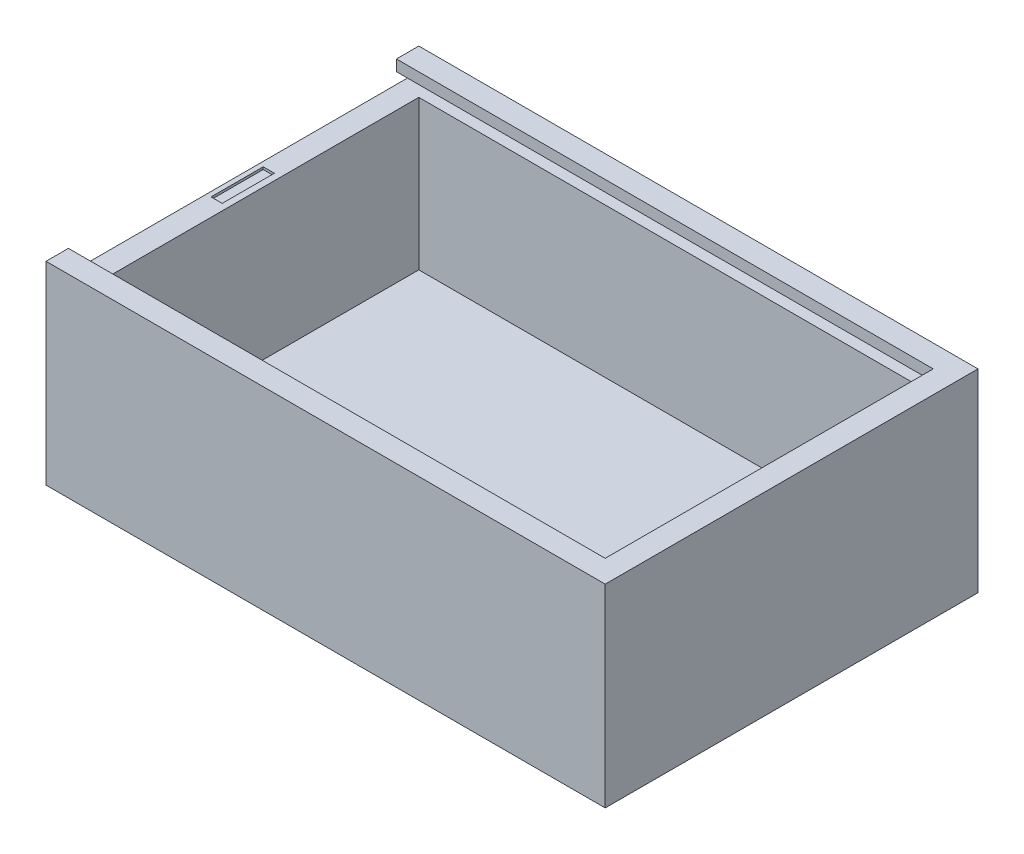
ISO-10303-21;
HEADER;
FILE_DESCRIPTION(('STEP AP214'),'2;1');
FILE_NAME('part.step','',(''),(''),'','','');
FILE_SCHEMA(('AUTOMOTIVE_DESIGN { 1 0 10303 214 1 1 1 1 }'));
ENDSEC;
DATA;
#1=APPLICATION_CONTEXT('core data for automotive mechanical design processes');
#2=APPLICATION_PROTOCOL_DEFINITION('international standard','automotive_design',2000,#1);
#3=PRODUCT_CONTEXT('',#1,'mechanical');
#4=PRODUCT('Part','Part','',(#3));
#5=PRODUCT_RELATED_PRODUCT_CATEGORY('part','',(#4));
#6=PRODUCT_DEFINITION_FORMATION('','',#4);
#7=PRODUCT_DEFINITION_CONTEXT('part definition',#1,'design');
#8=PRODUCT_DEFINITION('design','',#6,#7);
#9=PRODUCT_DEFINITION_SHAPE('','',#8);
#10=(LENGTH_UNIT() NAMED_UNIT(*) SI_UNIT(.MILLI.,.METRE.));
#11=(NAMED_UNIT(*) PLANE_ANGLE_UNIT() SI_UNIT($,.RADIAN.));
#12=(NAMED_UNIT(*) SI_UNIT($,.STERADIAN.) SOLID_ANGLE_UNIT());
#13=UNCERTAINTY_MEASURE_WITH_UNIT(LENGTH_MEASURE(1.E-05),#10,'distance_accuracy_value','');
#14=(GEOMETRIC_REPRESENTATION_CONTEXT(3) GLOBAL_UNCERTAINTY_ASSIGNED_CONTEXT((#13)) GLOBAL_UNIT_ASSIGNED_CONTEXT((#10,
#11,#12)) REPRESENTATION_CONTEXT('',''));
#15=CARTESIAN_POINT('',(0.,0.,0.));
#16=DIRECTION('',(0.,0.,1.));
#17=DIRECTION('',(1.,0.,0.));
#18=AXIS2_PLACEMENT_3D('',#15,#16,#17);
#19=CARTESIAN_POINT('',(34.5,26.,22.));
#20=DIRECTION('',(-1.,0.,0.));
#21=DIRECTION('',(0.,0.,1.));
#22=AXIS2_PLACEMENT_3D('',#19,#20,#21);
#23=PLANE('',#22);
#24=DIRECTION('',(0.,0.,1.));
#25=VECTOR('',#24,1.);
#26=CARTESIAN_POINT('',(34.5,23.04,23.48));
#27=LINE('',#26,#25);
#28=CARTESIAN_POINT('',(34.5,23.04,-22.));
#29=VERTEX_POINT('',#28);
#30=CARTESIAN_POINT('',(34.5,23.04,22.));
#31=VERTEX_POINT('',#30);
#32=EDGE_CURVE('E210',#29,#31,#27,.T.);
#33=ORIENTED_EDGE('',*,*,#32,.F.);
#34=DIRECTION('',(0.,-1.,0.));
#35=VECTOR('',#34,1.);
#36=CARTESIAN_POINT('',(34.5,26.,-22.));
#37=LINE('',#36,#35);
#38=CARTESIAN_POINT('',(34.5,3.00000000000001,-22.));
#39=VERTEX_POINT('',#38);
#40=EDGE_CURVE('E288',#29,#39,#37,.T.);
#41=ORIENTED_EDGE('',*,*,#40,.T.);
#42=DIRECTION('',(0.,0.,-1.));
#43=VECTOR('',#42,1.);
#44=CARTESIAN_POINT('',(34.5,3.,0.));
#45=LINE('',#44,#43);
#46=CARTESIAN_POINT('',(34.5,3.00000000000001,22.));
#47=VERTEX_POINT('',#46);
#48=EDGE_CURVE('E272',#47,#39,#45,.T.);
#49=ORIENTED_EDGE('',*,*,#48,.F.);
#50=DIRECTION('',(0.,-1.,0.));
#51=VECTOR('',#50,1.);
#52=CARTESIAN_POINT('',(34.5,26.,22.));
#53=LINE('',#52,#51);
#54=EDGE_CURVE('E60',#31,#47,#53,.T.);
#55=ORIENTED_EDGE('',*,*,#54,.F.);
#56=EDGE_LOOP('',(#33,#41,#49,#55));
#57=FACE_BOUND('',#56,.T.);
#58=ADVANCED_FACE('F37',(#57),#23,.T.);
#59=CARTESIAN_POINT('',(34.5,26.,22.));
#60=DIRECTION('',(0.,0.,-1.));
#61=DIRECTION('',(-1.,0.,0.));
#62=AXIS2_PLACEMENT_3D('',#59,#60,#61);
#63=PLANE('',#62);
#64=CARTESIAN_POINT('',(34.5,26.,22.));
#65=VERTEX_POINT('',#64);
#66=CARTESIAN_POINT('',(34.5,24.52,22.));
#67=VERTEX_POINT('',#66);
#68=EDGE_CURVE('E292',#65,#67,#53,.T.);
#69=ORIENTED_EDGE('',*,*,#68,.T.);
#70=DIRECTION('',(-1.,0.,0.));
#71=VECTOR('',#70,1.);
#72=CARTESIAN_POINT('',(34.5,24.52,22.));
#73=LINE('',#72,#71);
#74=CARTESIAN_POINT('',(-37.5,24.52,22.));
#75=VERTEX_POINT('',#74);
#76=EDGE_CURVE('E258',#67,#75,#73,.T.);
#77=ORIENTED_EDGE('',*,*,#76,.T.);
#78=DIRECTION('',(0.,1.,0.));
#79=VECTOR('',#78,1.);
#80=CARTESIAN_POINT('',(-37.5,0.,22.));
#81=LINE('',#80,#79);
#82=CARTESIAN_POINT('',(-37.5,26.,22.));
#83=VERTEX_POINT('',#82);
#84=EDGE_CURVE('E238',#75,#83,#81,.T.);
#85=ORIENTED_EDGE('',*,*,#84,.T.);
#86=DIRECTION('',(1.,0.,0.));
#87=VECTOR('',#86,1.);
#88=CARTESIAN_POINT('',(34.5,26.,22.));
#89=LINE('',#88,#87);
#90=EDGE_CURVE('E278',#83,#65,#89,.T.);
#91=ORIENTED_EDGE('',*,*,#90,.T.);
#92=EDGE_LOOP('',(#69,#77,#85,#91));
#93=FACE_BOUND('',#92,.T.);
#94=ADVANCED_FACE('F352',(#93),#63,.T.);
#95=CARTESIAN_POINT('',(34.5,26.,-22.));
#96=DIRECTION('',(0.,0.,1.));
#97=DIRECTION('',(1.,0.,0.));
#98=AXIS2_PLACEMENT_3D('',#95,#96,#97);
#99=PLANE('',#98);
#100=DIRECTION('',(1.,0.,0.));
#101=VECTOR('',#100,1.);
#102=CARTESIAN_POINT('',(34.5,23.04,-22.));
#103=LINE('',#102,#101);
#104=CARTESIAN_POINT('',(-34.5,23.04,-22.));
#105=VERTEX_POINT('',#104);
#106=EDGE_CURVE('E253',#105,#29,#103,.T.);
#107=ORIENTED_EDGE('',*,*,#106,.F.);
#108=DIRECTION('',(0.,-1.,0.));
#109=VECTOR('',#108,1.);
#110=CARTESIAN_POINT('',(-34.5,26.,-22.));
#111=LINE('',#110,#109);
#112=CARTESIAN_POINT('',(-34.5,3.00000000000001,-22.));
#113=VERTEX_POINT('',#112);
#114=EDGE_CURVE('E286',#105,#113,#111,.T.);
#115=ORIENTED_EDGE('',*,*,#114,.T.);
#116=DIRECTION('',(-1.,0.,0.));
#117=VECTOR('',#116,1.);
#118=CARTESIAN_POINT('',(0.,3.,-22.));
#119=LINE('',#118,#117);
#120=EDGE_CURVE('E275',#39,#113,#119,.T.);
#121=ORIENTED_EDGE('',*,*,#120,.F.);
#122=ORIENTED_EDGE('',*,*,#40,.F.);
#123=EDGE_LOOP('',(#107,#115,#121,#122));
#124=FACE_BOUND('',#123,.T.);
#125=ADVANCED_FACE('F386',(#124),#99,.T.);
#126=CARTESIAN_POINT('',(0.,26.,0.));
#127=DIRECTION('',(0.,1.,0.));
#128=DIRECTION('',(0.,0.,1.));
#129=AXIS2_PLACEMENT_3D('',#126,#127,#128);
#130=PLANE('',#129);
#131=DIRECTION('',(0.,0.,1.));
#132=VECTOR('',#131,1.);
#133=CARTESIAN_POINT('',(-37.5,26.,-25.));
#134=LINE('',#133,#132);
#135=CARTESIAN_POINT('',(-37.5,26.,-25.));
#136=VERTEX_POINT('',#135);
#137=CARTESIAN_POINT('',(-37.5,26.,-22.));
#138=VERTEX_POINT('',#137);
#139=EDGE_CURVE('E296',#136,#138,#134,.T.);
#140=ORIENTED_EDGE('',*,*,#139,.T.);
#141=DIRECTION('',(-1.,0.,0.));
#142=VECTOR('',#141,1.);
#143=CARTESIAN_POINT('',(34.5,26.,-22.));
#144=LINE('',#143,#142);
#145=CARTESIAN_POINT('',(34.5,26.,-22.));
#146=VERTEX_POINT('',#145);
#147=EDGE_CURVE('E282',#146,#138,#144,.T.);
#148=ORIENTED_EDGE('',*,*,#147,.F.);
#149=DIRECTION('',(0.,0.,-1.));
#150=VECTOR('',#149,1.);
#151=CARTESIAN_POINT('',(34.5,26.,22.));
#152=LINE('',#151,#150);
#153=EDGE_CURVE('E280',#65,#146,#152,.T.);
#154=ORIENTED_EDGE('',*,*,#153,.F.);
#155=ORIENTED_EDGE('',*,*,#90,.F.);
#156=CARTESIAN_POINT('',(-37.5,26.,25.));
#157=VERTEX_POINT('',#156);
#158=EDGE_CURVE('E300',#83,#157,#134,.T.);
#159=ORIENTED_EDGE('',*,*,#158,.T.);
#160=DIRECTION('',(1.,0.,0.));
#161=VECTOR('',#160,1.);
#162=CARTESIAN_POINT('',(-37.5,26.,25.));
#163=LINE('',#162,#161);
#164=CARTESIAN_POINT('',(37.5,26.,25.));
#165=VERTEX_POINT('',#164);
#166=EDGE_CURVE('E299',#157,#165,#163,.T.);
#167=ORIENTED_EDGE('',*,*,#166,.T.);
#168=DIRECTION('',(0.,0.,-1.));
#169=VECTOR('',#168,1.);
#170=CARTESIAN_POINT('',(37.5,26.,-25.));
#171=LINE('',#170,#169);
#172=CARTESIAN_POINT('',(37.5,26.,-25.));
#173=VERTEX_POINT('',#172);
#174=EDGE_CURVE('E302',#165,#173,#171,.T.);
#175=ORIENTED_EDGE('',*,*,#174,.T.);
#176=DIRECTION('',(-1.,0.,0.));
#177=VECTOR('',#176,1.);
#178=CARTESIAN_POINT('',(-37.5,26.,-25.));
#179=LINE('',#178,#177);
#180=EDGE_CURVE('E304',#173,#136,#179,.T.);
#181=ORIENTED_EDGE('',*,*,#180,.T.);
#182=EDGE_LOOP('',(#140,#148,#154,#155,#159,#167,#175,#181));
#183=FACE_BOUND('',#182,.T.);
#184=ADVANCED_FACE('F346',(#183),#130,.T.);
#185=CARTESIAN_POINT('',(0.,0.,0.));
#186=DIRECTION('',(0.,1.,0.));
#187=DIRECTION('',(0.,0.,1.));
#188=AXIS2_PLACEMENT_3D('',#185,#186,#187);
#189=PLANE('',#188);
#190=DIRECTION('',(0.,0.,1.));
#191=VECTOR('',#190,1.);
#192=CARTESIAN_POINT('',(-37.5,0.,-25.));
#193=LINE('',#192,#191);
#194=CARTESIAN_POINT('',(-37.5,0.,-25.));
#195=VERTEX_POINT('',#194);
#196=CARTESIAN_POINT('',(-37.5,0.,25.));
#197=VERTEX_POINT('',#196);
#198=EDGE_CURVE('E295',#195,#197,#193,.T.);
#199=ORIENTED_EDGE('',*,*,#198,.F.);
#200=DIRECTION('',(-1.,0.,0.));
#201=VECTOR('',#200,1.);
#202=CARTESIAN_POINT('',(-37.5,0.,-25.));
#203=LINE('',#202,#201);
#204=CARTESIAN_POINT('',(37.5,0.,-25.));
#205=VERTEX_POINT('',#204);
#206=EDGE_CURVE('E313',#205,#195,#203,.T.);
#207=ORIENTED_EDGE('',*,*,#206,.F.);
#208=DIRECTION('',(0.,0.,-1.));
#209=VECTOR('',#208,1.);
#210=CARTESIAN_POINT('',(37.5,0.,-25.));
#211=LINE('',#210,#209);
#212=CARTESIAN_POINT('',(37.5,0.,25.));
#213=VERTEX_POINT('',#212);
#214=EDGE_CURVE('E311',#213,#205,#211,.T.);
#215=ORIENTED_EDGE('',*,*,#214,.F.);
#216=DIRECTION('',(1.,0.,0.));
#217=VECTOR('',#216,1.);
#218=CARTESIAN_POINT('',(-37.5,0.,25.));
#219=LINE('',#218,#217);
#220=EDGE_CURVE('E309',#197,#213,#219,.T.);
#221=ORIENTED_EDGE('',*,*,#220,.F.);
#222=EDGE_LOOP('',(#199,#207,#215,#221));
#223=FACE_BOUND('',#222,.T.);
#224=ADVANCED_FACE('F336',(#223),#189,.F.);
#225=CARTESIAN_POINT('',(-37.5,26.,-25.));
#226=DIRECTION('',(1.,0.,0.));
#227=DIRECTION('',(0.,0.,-1.));
#228=AXIS2_PLACEMENT_3D('',#225,#226,#227);
#229=PLANE('',#228);
#230=DIRECTION('',(0.,0.,-1.));
#231=VECTOR('',#230,1.);
#232=CARTESIAN_POINT('',(-37.5,24.52,0.));
#233=LINE('',#232,#231);
#234=CARTESIAN_POINT('',(-37.5,24.52,-22.));
#235=VERTEX_POINT('',#234);
#236=CARTESIAN_POINT('',(-37.5,24.52,-23.48));
#237=VERTEX_POINT('',#236);
#238=EDGE_CURVE('E244',#235,#237,#233,.T.);
#239=ORIENTED_EDGE('',*,*,#238,.F.);
#240=DIRECTION('',(0.,-1.,0.));
#241=VECTOR('',#240,1.);
#242=CARTESIAN_POINT('',(-37.5,0.,-22.));
#243=LINE('',#242,#241);
#244=EDGE_CURVE('E241',#138,#235,#243,.T.);
#245=ORIENTED_EDGE('',*,*,#244,.F.);
#246=ORIENTED_EDGE('',*,*,#139,.F.);
#247=DIRECTION('',(0.,-1.,0.));
#248=VECTOR('',#247,1.);
#249=CARTESIAN_POINT('',(-37.5,26.,-25.));
#250=LINE('',#249,#248);
#251=EDGE_CURVE('E306',#136,#195,#250,.T.);
#252=ORIENTED_EDGE('',*,*,#251,.T.);
#253=ORIENTED_EDGE('',*,*,#198,.T.);
#254=DIRECTION('',(0.,-1.,0.));
#255=VECTOR('',#254,1.);
#256=CARTESIAN_POINT('',(-37.5,26.,25.));
#257=LINE('',#256,#255);
#258=EDGE_CURVE('E45',#157,#197,#257,.T.);
#259=ORIENTED_EDGE('',*,*,#258,.F.);
#260=ORIENTED_EDGE('',*,*,#158,.F.);
#261=ORIENTED_EDGE('',*,*,#84,.F.);
#262=DIRECTION('',(0.,0.,1.));
#263=VECTOR('',#262,1.);
#264=CARTESIAN_POINT('',(-37.5,24.52,0.));
#265=LINE('',#264,#263);
#266=CARTESIAN_POINT('',(-37.5,24.52,23.48));
#267=VERTEX_POINT('',#266);
#268=EDGE_CURVE('E235',#75,#267,#265,.T.);
#269=ORIENTED_EDGE('',*,*,#268,.T.);
#270=DIRECTION('',(0.,-1.,0.));
#271=VECTOR('',#270,1.);
#272=CARTESIAN_POINT('',(-37.5,0.,23.48));
#273=LINE('',#272,#271);
#274=CARTESIAN_POINT('',(-37.5,23.04,23.48));
#275=VERTEX_POINT('',#274);
#276=EDGE_CURVE('E232',#267,#275,#273,.T.);
#277=ORIENTED_EDGE('',*,*,#276,.T.);
#278=DIRECTION('',(0.,0.,1.));
#279=VECTOR('',#278,1.);
#280=CARTESIAN_POINT('',(-37.5,23.04,0.));
#281=LINE('',#280,#279);
#282=CARTESIAN_POINT('',(-37.5,23.04,-23.48));
#283=VERTEX_POINT('',#282);
#284=EDGE_CURVE('E227',#283,#275,#281,.T.);
#285=ORIENTED_EDGE('',*,*,#284,.F.);
#286=DIRECTION('',(0.,-1.,0.));
#287=VECTOR('',#286,1.);
#288=CARTESIAN_POINT('',(-37.5,0.,-23.48));
#289=LINE('',#288,#287);
#290=EDGE_CURVE('E247',#237,#283,#289,.T.);
#291=ORIENTED_EDGE('',*,*,#290,.F.);
#292=EDGE_LOOP('',(#239,#245,#246,#252,#253,#259,#260,#261,#269,#277,#285,#291));
#293=FACE_BOUND('',#292,.T.);
#294=ADVANCED_FACE('F39',(#293),#229,.F.);
#295=CARTESIAN_POINT('',(-37.5,26.,25.));
#296=DIRECTION('',(0.,0.,-1.));
#297=DIRECTION('',(-1.,0.,0.));
#298=AXIS2_PLACEMENT_3D('',#295,#296,#297);
#299=PLANE('',#298);
#300=ORIENTED_EDGE('',*,*,#220,.T.);
#301=DIRECTION('',(0.,-1.,0.));
#302=VECTOR('',#301,1.);
#303=CARTESIAN_POINT('',(37.5,26.,25.));
#304=LINE('',#303,#302);
#305=EDGE_CURVE('E320',#165,#213,#304,.T.);
#306=ORIENTED_EDGE('',*,*,#305,.F.);
#307=ORIENTED_EDGE('',*,*,#166,.F.);
#308=ORIENTED_EDGE('',*,*,#258,.T.);
#309=EDGE_LOOP('',(#300,#306,#307,#308));
#310=FACE_BOUND('',#309,.T.);
#311=ADVANCED_FACE('F326',(#310),#299,.F.);
#312=CARTESIAN_POINT('',(37.5,26.,-25.));
#313=DIRECTION('',(-1.,0.,0.));
#314=DIRECTION('',(0.,0.,1.));
#315=AXIS2_PLACEMENT_3D('',#312,#313,#314);
#316=PLANE('',#315);
#317=ORIENTED_EDGE('',*,*,#214,.T.);
#318=DIRECTION('',(0.,-1.,0.));
#319=VECTOR('',#318,1.);
#320=CARTESIAN_POINT('',(37.5,26.,-25.));
#321=LINE('',#320,#319);
#322=EDGE_CURVE('E317',#173,#205,#321,.T.);
#323=ORIENTED_EDGE('',*,*,#322,.F.);
#324=ORIENTED_EDGE('',*,*,#174,.F.);
#325=ORIENTED_EDGE('',*,*,#305,.T.);
#326=EDGE_LOOP('',(#317,#323,#324,#325));
#327=FACE_BOUND('',#326,.T.);
#328=ADVANCED_FACE('F340',(#327),#316,.F.);
#329=CARTESIAN_POINT('',(-37.5,26.,-25.));
#330=DIRECTION('',(0.,0.,1.));
#331=DIRECTION('',(1.,0.,0.));
#332=AXIS2_PLACEMENT_3D('',#329,#330,#331);
#333=PLANE('',#332);
#334=ORIENTED_EDGE('',*,*,#206,.T.);
#335=ORIENTED_EDGE('',*,*,#251,.F.);
#336=ORIENTED_EDGE('',*,*,#180,.F.);
#337=ORIENTED_EDGE('',*,*,#322,.T.);
#338=EDGE_LOOP('',(#334,#335,#336,#337));
#339=FACE_BOUND('',#338,.T.);
#340=ADVANCED_FACE('F344',(#339),#333,.F.);
#341=DIRECTION('',(-1.,0.,0.));
#342=VECTOR('',#341,1.);
#343=CARTESIAN_POINT('',(34.5,23.04,22.));
#344=LINE('',#343,#342);
#345=CARTESIAN_POINT('',(-34.5,23.04,22.));
#346=VERTEX_POINT('',#345);
#347=EDGE_CURVE('E265',#31,#346,#344,.T.);
#348=ORIENTED_EDGE('',*,*,#347,.F.);
#349=ORIENTED_EDGE('',*,*,#54,.T.);
#350=DIRECTION('',(-1.,0.,0.));
#351=VECTOR('',#350,1.);
#352=CARTESIAN_POINT('',(0.,3.,22.));
#353=LINE('',#352,#351);
#354=CARTESIAN_POINT('',(-34.5,3.,22.));
#355=VERTEX_POINT('',#354);
#356=EDGE_CURVE('E270',#47,#355,#353,.T.);
#357=ORIENTED_EDGE('',*,*,#356,.T.);
#358=DIRECTION('',(0.,-1.,0.));
#359=VECTOR('',#358,1.);
#360=CARTESIAN_POINT('',(-34.5,26.,22.));
#361=LINE('',#360,#359);
#362=EDGE_CURVE('E284',#346,#355,#361,.T.);
#363=ORIENTED_EDGE('',*,*,#362,.F.);
#364=EDGE_LOOP('',(#348,#349,#357,#363));
#365=FACE_BOUND('',#364,.T.);
#366=ADVANCED_FACE('F378',(#365),#63,.T.);
#367=DIRECTION('',(0.,0.,-1.));
#368=VECTOR('',#367,1.);
#369=CARTESIAN_POINT('',(34.5,24.52,-23.48));
#370=LINE('',#369,#368);
#371=CARTESIAN_POINT('',(34.5,24.52,-22.));
#372=VERTEX_POINT('',#371);
#373=EDGE_CURVE('E218',#67,#372,#370,.T.);
#374=ORIENTED_EDGE('',*,*,#373,.F.);
#375=ORIENTED_EDGE('',*,*,#68,.F.);
#376=ORIENTED_EDGE('',*,*,#153,.T.);
#377=EDGE_CURVE('E289',#146,#372,#37,.T.);
#378=ORIENTED_EDGE('',*,*,#377,.T.);
#379=EDGE_LOOP('',(#374,#375,#376,#378));
#380=FACE_BOUND('',#379,.T.);
#381=ADVANCED_FACE('F376',(#380),#23,.T.);
#382=DIRECTION('',(-1.,0.,0.));
#383=VECTOR('',#382,1.);
#384=CARTESIAN_POINT('',(34.5,24.52,-22.));
#385=LINE('',#384,#383);
#386=EDGE_CURVE('E256',#372,#235,#385,.T.);
#387=ORIENTED_EDGE('',*,*,#386,.F.);
#388=ORIENTED_EDGE('',*,*,#377,.F.);
#389=ORIENTED_EDGE('',*,*,#147,.T.);
#390=ORIENTED_EDGE('',*,*,#244,.T.);
#391=EDGE_LOOP('',(#387,#388,#389,#390));
#392=FACE_BOUND('',#391,.T.);
#393=ADVANCED_FACE('F373',(#392),#99,.T.);
#394=CARTESIAN_POINT('',(-34.5,26.,22.));
#395=DIRECTION('',(1.,0.,0.));
#396=DIRECTION('',(0.,0.,-1.));
#397=AXIS2_PLACEMENT_3D('',#394,#395,#396);
#398=PLANE('',#397);
#399=DIRECTION('',(0.,0.,-1.));
#400=VECTOR('',#399,1.);
#401=CARTESIAN_POINT('',(-34.5,23.04,22.));
#402=LINE('',#401,#400);
#403=EDGE_CURVE('E11',#346,#105,#402,.T.);
#404=ORIENTED_EDGE('',*,*,#403,.F.);
#405=ORIENTED_EDGE('',*,*,#362,.T.);
#406=DIRECTION('',(0.,0.,-1.));
#407=VECTOR('',#406,1.);
#408=CARTESIAN_POINT('',(-34.5,3.,0.));
#409=LINE('',#408,#407);
#410=EDGE_CURVE('E267',#355,#113,#409,.T.);
#411=ORIENTED_EDGE('',*,*,#410,.T.);
#412=ORIENTED_EDGE('',*,*,#114,.F.);
#413=EDGE_LOOP('',(#404,#405,#411,#412));
#414=FACE_BOUND('',#413,.T.);
#415=ADVANCED_FACE('F384',(#414),#398,.T.);
#416=CARTESIAN_POINT('',(0.,3.,0.));
#417=DIRECTION('',(0.,1.,0.));
#418=DIRECTION('',(0.,0.,1.));
#419=AXIS2_PLACEMENT_3D('',#416,#417,#418);
#420=PLANE('',#419);
#421=ORIENTED_EDGE('',*,*,#410,.F.);
#422=ORIENTED_EDGE('',*,*,#356,.F.);
#423=ORIENTED_EDGE('',*,*,#48,.T.);
#424=ORIENTED_EDGE('',*,*,#120,.T.);
#425=EDGE_LOOP('',(#421,#422,#423,#424));
#426=FACE_BOUND('',#425,.T.);
#427=ADVANCED_FACE('F403',(#426),#420,.T.);
#428=CARTESIAN_POINT('',(34.5,23.04,0.));
#429=DIRECTION('',(0.,-1.,0.));
#430=DIRECTION('',(0.,0.,-1.));
#431=AXIS2_PLACEMENT_3D('',#428,#429,#430);
#432=PLANE('',#431);
#433=DIRECTION('',(1.,0.,0.));
#434=VECTOR('',#433,1.);
#435=CARTESIAN_POINT('',(-36.87,23.04,3.5));
#436=LINE('',#435,#434);
#437=CARTESIAN_POINT('',(-36.87,23.04,3.5));
#438=VERTEX_POINT('',#437);
#439=CARTESIAN_POINT('',(-35.37,23.04,3.5));
#440=VERTEX_POINT('',#439);
#441=EDGE_CURVE('E204',#438,#440,#436,.T.);
#442=ORIENTED_EDGE('',*,*,#441,.F.);
#443=DIRECTION('',(0.,0.,1.));
#444=VECTOR('',#443,1.);
#445=CARTESIAN_POINT('',(-36.87,23.04,3.5));
#446=LINE('',#445,#444);
#447=CARTESIAN_POINT('',(-36.87,23.04,-3.5));
#448=VERTEX_POINT('',#447);
#449=EDGE_CURVE('E52',#448,#438,#446,.T.);
#450=ORIENTED_EDGE('',*,*,#449,.F.);
#451=DIRECTION('',(-1.,0.,0.));
#452=VECTOR('',#451,1.);
#453=CARTESIAN_POINT('',(-36.87,23.04,-3.5));
#454=LINE('',#453,#452);
#455=CARTESIAN_POINT('',(-35.37,23.04,-3.5));
#456=VERTEX_POINT('',#455);
#457=EDGE_CURVE('E195',#456,#448,#454,.T.);
#458=ORIENTED_EDGE('',*,*,#457,.F.);
#459=DIRECTION('',(0.,0.,-1.));
#460=VECTOR('',#459,1.);
#461=CARTESIAN_POINT('',(-35.37,23.04,3.5));
#462=LINE('',#461,#460);
#463=EDGE_CURVE('E198',#440,#456,#462,.T.);
#464=ORIENTED_EDGE('',*,*,#463,.F.);
#465=EDGE_LOOP('',(#442,#450,#458,#464));
#466=FACE_BOUND('',#465,.T.);
#467=ORIENTED_EDGE('',*,*,#106,.T.);
#468=ORIENTED_EDGE('',*,*,#32,.T.);
#469=ORIENTED_EDGE('',*,*,#347,.T.);
#470=ORIENTED_EDGE('',*,*,#403,.T.);
#471=EDGE_LOOP('',(#467,#468,#469,#470));
#472=FACE_BOUND('',#471,.T.);
#473=DIRECTION('',(0.,0.,1.));
#474=VECTOR('',#473,1.);
#475=CARTESIAN_POINT('',(36.,23.04,23.48));
#476=LINE('',#475,#474);
#477=CARTESIAN_POINT('',(36.,23.04,-23.48));
#478=VERTEX_POINT('',#477);
#479=CARTESIAN_POINT('',(36.,23.04,23.48));
#480=VERTEX_POINT('',#479);
#481=EDGE_CURVE('E214',#478,#480,#476,.T.);
#482=ORIENTED_EDGE('',*,*,#481,.F.);
#483=DIRECTION('',(-1.,0.,0.));
#484=VECTOR('',#483,1.);
#485=CARTESIAN_POINT('',(34.5,23.04,-23.48));
#486=LINE('',#485,#484);
#487=EDGE_CURVE('E251',#478,#283,#486,.T.);
#488=ORIENTED_EDGE('',*,*,#487,.T.);
#489=ORIENTED_EDGE('',*,*,#284,.T.);
#490=DIRECTION('',(-1.,0.,0.));
#491=VECTOR('',#490,1.);
#492=CARTESIAN_POINT('',(34.5,23.04,23.48));
#493=LINE('',#492,#491);
#494=EDGE_CURVE('E250',#480,#275,#493,.T.);
#495=ORIENTED_EDGE('',*,*,#494,.F.);
#496=EDGE_LOOP('',(#482,#488,#489,#495));
#497=FACE_BOUND('',#496,.T.);
#498=ADVANCED_FACE('F366',(#466,#472,#497),#432,.F.);
#499=CARTESIAN_POINT('',(34.5,0.,-23.48));
#500=DIRECTION('',(0.,0.,-1.));
#501=DIRECTION('',(-1.,0.,0.));
#502=AXIS2_PLACEMENT_3D('',#499,#500,#501);
#503=PLANE('',#502);
#504=ORIENTED_EDGE('',*,*,#290,.T.);
#505=ORIENTED_EDGE('',*,*,#487,.F.);
#506=DIRECTION('',(0.,-1.,0.));
#507=VECTOR('',#506,1.);
#508=CARTESIAN_POINT('',(36.,23.04,-23.48));
#509=LINE('',#508,#507);
#510=CARTESIAN_POINT('',(36.,24.52,-23.48));
#511=VERTEX_POINT('',#510);
#512=EDGE_CURVE('E224',#511,#478,#509,.T.);
#513=ORIENTED_EDGE('',*,*,#512,.F.);
#514=DIRECTION('',(-1.,0.,0.));
#515=VECTOR('',#514,1.);
#516=CARTESIAN_POINT('',(34.5,24.52,-23.48));
#517=LINE('',#516,#515);
#518=EDGE_CURVE('E254',#511,#237,#517,.T.);
#519=ORIENTED_EDGE('',*,*,#518,.T.);
#520=EDGE_LOOP('',(#504,#505,#513,#519));
#521=FACE_BOUND('',#520,.T.);
#522=ADVANCED_FACE('F369',(#521),#503,.F.);
#523=CARTESIAN_POINT('',(34.5,24.52,0.));
#524=DIRECTION('',(0.,1.,0.));
#525=DIRECTION('',(0.,0.,1.));
#526=AXIS2_PLACEMENT_3D('',#523,#524,#525);
#527=PLANE('',#526);
#528=ORIENTED_EDGE('',*,*,#238,.T.);
#529=ORIENTED_EDGE('',*,*,#518,.F.);
#530=DIRECTION('',(0.,0.,-1.));
#531=VECTOR('',#530,1.);
#532=CARTESIAN_POINT('',(36.,24.52,-23.48));
#533=LINE('',#532,#531);
#534=CARTESIAN_POINT('',(36.,24.52,23.48));
#535=VERTEX_POINT('',#534);
#536=EDGE_CURVE('E221',#535,#511,#533,.T.);
#537=ORIENTED_EDGE('',*,*,#536,.F.);
#538=DIRECTION('',(-1.,0.,0.));
#539=VECTOR('',#538,1.);
#540=CARTESIAN_POINT('',(34.5,24.52,23.48));
#541=LINE('',#540,#539);
#542=EDGE_CURVE('E260',#535,#267,#541,.T.);
#543=ORIENTED_EDGE('',*,*,#542,.T.);
#544=ORIENTED_EDGE('',*,*,#268,.F.);
#545=ORIENTED_EDGE('',*,*,#76,.F.);
#546=ORIENTED_EDGE('',*,*,#373,.T.);
#547=ORIENTED_EDGE('',*,*,#386,.T.);
#548=EDGE_LOOP('',(#528,#529,#537,#543,#544,#545,#546,#547));
#549=FACE_BOUND('',#548,.T.);
#550=ADVANCED_FACE('F356',(#549),#527,.F.);
#551=CARTESIAN_POINT('',(34.5,0.,23.48));
#552=DIRECTION('',(0.,0.,-1.));
#553=DIRECTION('',(-1.,0.,0.));
#554=AXIS2_PLACEMENT_3D('',#551,#552,#553);
#555=PLANE('',#554);
#556=ORIENTED_EDGE('',*,*,#276,.F.);
#557=ORIENTED_EDGE('',*,*,#542,.F.);
#558=DIRECTION('',(0.,1.,0.));
#559=VECTOR('',#558,1.);
#560=CARTESIAN_POINT('',(36.,24.52,23.48));
#561=LINE('',#560,#559);
#562=EDGE_CURVE('E217',#480,#535,#561,.T.);
#563=ORIENTED_EDGE('',*,*,#562,.F.);
#564=ORIENTED_EDGE('',*,*,#494,.T.);
#565=EDGE_LOOP('',(#556,#557,#563,#564));
#566=FACE_BOUND('',#565,.T.);
#567=ADVANCED_FACE('F361',(#566),#555,.T.);
#568=CARTESIAN_POINT('',(36.,0.,0.));
#569=DIRECTION('',(1.,0.,0.));
#570=DIRECTION('',(0.,0.,-1.));
#571=AXIS2_PLACEMENT_3D('',#568,#569,#570);
#572=PLANE('',#571);
#573=ORIENTED_EDGE('',*,*,#481,.T.);
#574=ORIENTED_EDGE('',*,*,#562,.T.);
#575=ORIENTED_EDGE('',*,*,#536,.T.);
#576=ORIENTED_EDGE('',*,*,#512,.T.);
#577=EDGE_LOOP('',(#573,#574,#575,#576));
#578=FACE_BOUND('',#577,.T.);
#579=ADVANCED_FACE('F418',(#578),#572,.F.);
#580=CARTESIAN_POINT('',(-36.87,22.72,3.5));
#581=DIRECTION('',(-1.,0.,0.));
#582=DIRECTION('',(0.,0.,1.));
#583=AXIS2_PLACEMENT_3D('',#580,#581,#582);
#584=PLANE('',#583);
#585=ORIENTED_EDGE('',*,*,#449,.T.);
#586=DIRECTION('',(0.,1.,0.));
#587=VECTOR('',#586,1.);
#588=CARTESIAN_POINT('',(-36.87,22.72,3.5));
#589=LINE('',#588,#587);
#590=CARTESIAN_POINT('',(-36.87,22.72,3.5));
#591=VERTEX_POINT('',#590);
#592=EDGE_CURVE('E173',#591,#438,#589,.T.);
#593=ORIENTED_EDGE('',*,*,#592,.F.);
#594=DIRECTION('',(0.,0.,1.));
#595=VECTOR('',#594,1.);
#596=CARTESIAN_POINT('',(-36.87,22.72,3.5));
#597=LINE('',#596,#595);
#598=CARTESIAN_POINT('',(-36.87,22.72,-3.5));
#599=VERTEX_POINT('',#598);
#600=EDGE_CURVE('E177',#599,#591,#597,.T.);
#601=ORIENTED_EDGE('',*,*,#600,.F.);
#602=DIRECTION('',(0.,1.,0.));
#603=VECTOR('',#602,1.);
#604=CARTESIAN_POINT('',(-36.87,22.72,-3.5));
#605=LINE('',#604,#603);
#606=EDGE_CURVE('E208',#599,#448,#605,.T.);
#607=ORIENTED_EDGE('',*,*,#606,.T.);
#608=EDGE_LOOP('',(#585,#593,#601,#607));
#609=FACE_BOUND('',#608,.T.);
#610=ADVANCED_FACE('F175',(#609),#584,.F.);
#611=CARTESIAN_POINT('',(-36.87,22.72,-3.5));
#612=DIRECTION('',(0.,0.,-1.));
#613=DIRECTION('',(-1.,0.,0.));
#614=AXIS2_PLACEMENT_3D('',#611,#612,#613);
#615=PLANE('',#614);
#616=ORIENTED_EDGE('',*,*,#457,.T.);
#617=ORIENTED_EDGE('',*,*,#606,.F.);
#618=DIRECTION('',(-1.,0.,0.));
#619=VECTOR('',#618,1.);
#620=CARTESIAN_POINT('',(-36.87,22.72,-3.5));
#621=LINE('',#620,#619);
#622=CARTESIAN_POINT('',(-35.37,22.72,-3.5));
#623=VERTEX_POINT('',#622);
#624=EDGE_CURVE('E183',#623,#599,#621,.T.);
#625=ORIENTED_EDGE('',*,*,#624,.F.);
#626=DIRECTION('',(0.,1.,0.));
#627=VECTOR('',#626,1.);
#628=CARTESIAN_POINT('',(-35.37,22.72,-3.5));
#629=LINE('',#628,#627);
#630=EDGE_CURVE('E211',#623,#456,#629,.T.);
#631=ORIENTED_EDGE('',*,*,#630,.T.);
#632=EDGE_LOOP('',(#616,#617,#625,#631));
#633=FACE_BOUND('',#632,.T.);
#634=ADVANCED_FACE('F428',(#633),#615,.F.);
#635=CARTESIAN_POINT('',(-35.37,22.72,3.5));
#636=DIRECTION('',(1.,0.,0.));
#637=DIRECTION('',(0.,0.,-1.));
#638=AXIS2_PLACEMENT_3D('',#635,#636,#637);
#639=PLANE('',#638);
#640=ORIENTED_EDGE('',*,*,#463,.T.);
#641=ORIENTED_EDGE('',*,*,#630,.F.);
#642=DIRECTION('',(0.,0.,-1.));
#643=VECTOR('',#642,1.);
#644=CARTESIAN_POINT('',(-35.37,22.72,3.5));
#645=LINE('',#644,#643);
#646=CARTESIAN_POINT('',(-35.37,22.72,3.5));
#647=VERTEX_POINT('',#646);
#648=EDGE_CURVE('E191',#647,#623,#645,.T.);
#649=ORIENTED_EDGE('',*,*,#648,.F.);
#650=DIRECTION('',(0.,1.,0.));
#651=VECTOR('',#650,1.);
#652=CARTESIAN_POINT('',(-35.37,22.72,3.5));
#653=LINE('',#652,#651);
#654=EDGE_CURVE('E182',#647,#440,#653,.T.);
#655=ORIENTED_EDGE('',*,*,#654,.T.);
#656=EDGE_LOOP('',(#640,#641,#649,#655));
#657=FACE_BOUND('',#656,.T.);
#658=ADVANCED_FACE('F431',(#657),#639,.F.);
#659=CARTESIAN_POINT('',(-36.87,22.72,3.5));
#660=DIRECTION('',(0.,0.,1.));
#661=DIRECTION('',(1.,0.,0.));
#662=AXIS2_PLACEMENT_3D('',#659,#660,#661);
#663=PLANE('',#662);
#664=ORIENTED_EDGE('',*,*,#441,.T.);
#665=ORIENTED_EDGE('',*,*,#654,.F.);
#666=DIRECTION('',(1.,0.,0.));
#667=VECTOR('',#666,1.);
#668=CARTESIAN_POINT('',(-36.87,22.72,3.5));
#669=LINE('',#668,#667);
#670=EDGE_CURVE('E186',#591,#647,#669,.T.);
#671=ORIENTED_EDGE('',*,*,#670,.F.);
#672=ORIENTED_EDGE('',*,*,#592,.T.);
#673=EDGE_LOOP('',(#664,#665,#671,#672));
#674=FACE_BOUND('',#673,.T.);
#675=ADVANCED_FACE('F187',(#674),#663,.F.);
#676=CARTESIAN_POINT('',(0.,22.72,0.));
#677=DIRECTION('',(0.,-1.,0.));
#678=DIRECTION('',(0.,0.,-1.));
#679=AXIS2_PLACEMENT_3D('',#676,#677,#678);
#680=PLANE('',#679);
#681=ORIENTED_EDGE('',*,*,#600,.T.);
#682=ORIENTED_EDGE('',*,*,#670,.T.);
#683=ORIENTED_EDGE('',*,*,#648,.T.);
#684=ORIENTED_EDGE('',*,*,#624,.T.);
#685=EDGE_LOOP('',(#681,#682,#683,#684));
#686=FACE_BOUND('',#685,.T.);
#687=ADVANCED_FACE('F193',(#686),#680,.F.);
#688=CLOSED_SHELL('',(#58,#94,#125,#184,#224,#294,#311,#328,#340,#366,#381,#393,#415,#427,#498,
#522,#550,#567,#579,#610,#634,#658,#675,#687));
#689=MANIFOLD_SOLID_BREP('B2',#688);
#690=ADVANCED_BREP_SHAPE_REPRESENTATION('',(#18,#689),#14);
#691=SHAPE_DEFINITION_REPRESENTATION(#9,#690);
ENDSEC;
END-ISO-10303-21;
